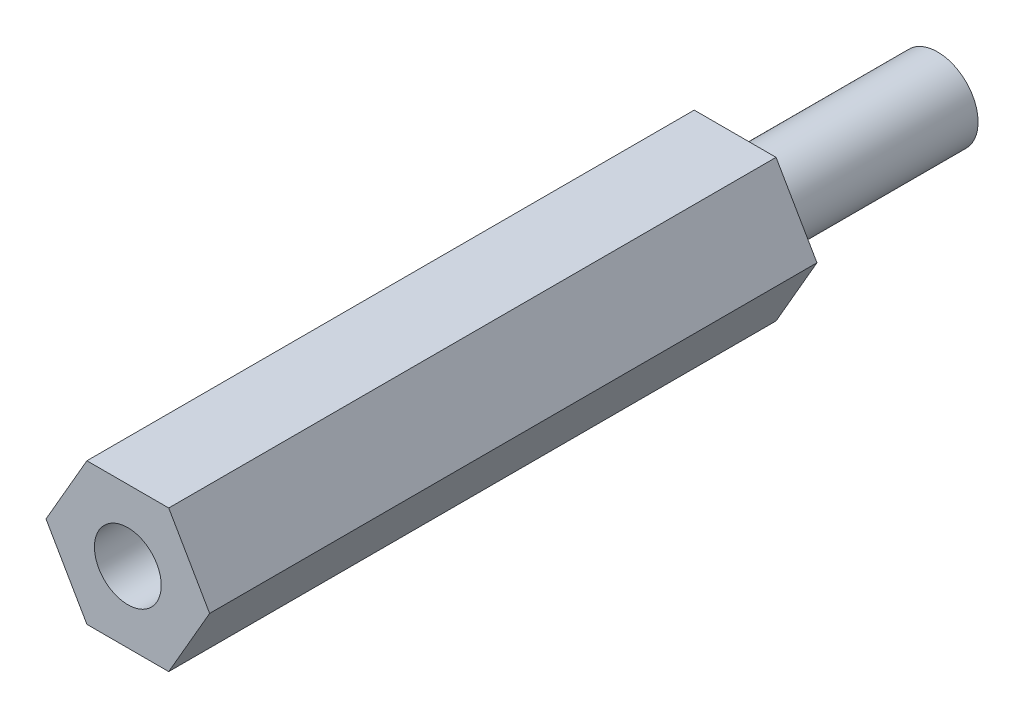
ISO-10303-21;
HEADER;
FILE_DESCRIPTION(('STEP AP214'),'2;1');
FILE_NAME('part.step','',(''),(''),'','','');
FILE_SCHEMA(('AUTOMOTIVE_DESIGN { 1 0 10303 214 1 1 1 1 }'));
ENDSEC;
DATA;
#1=APPLICATION_CONTEXT('core data for automotive mechanical design processes');
#2=APPLICATION_PROTOCOL_DEFINITION('international standard','automotive_design',2000,#1);
#3=PRODUCT_CONTEXT('',#1,'mechanical');
#4=PRODUCT('Part','Part','',(#3));
#5=PRODUCT_RELATED_PRODUCT_CATEGORY('part','',(#4));
#6=PRODUCT_DEFINITION_FORMATION('','',#4);
#7=PRODUCT_DEFINITION_CONTEXT('part definition',#1,'design');
#8=PRODUCT_DEFINITION('design','',#6,#7);
#9=PRODUCT_DEFINITION_SHAPE('','',#8);
#10=(LENGTH_UNIT() NAMED_UNIT(*) SI_UNIT(.MILLI.,.METRE.));
#11=(NAMED_UNIT(*) PLANE_ANGLE_UNIT() SI_UNIT($,.RADIAN.));
#12=(NAMED_UNIT(*) SI_UNIT($,.STERADIAN.) SOLID_ANGLE_UNIT());
#13=UNCERTAINTY_MEASURE_WITH_UNIT(LENGTH_MEASURE(1.E-05),#10,'distance_accuracy_value','');
#14=(GEOMETRIC_REPRESENTATION_CONTEXT(3) GLOBAL_UNCERTAINTY_ASSIGNED_CONTEXT((#13)) GLOBAL_UNIT_ASSIGNED_CONTEXT((#10,
#11,#12)) REPRESENTATION_CONTEXT('',''));
#15=CARTESIAN_POINT('',(0.,0.,0.));
#16=DIRECTION('',(0.,0.,1.));
#17=DIRECTION('',(1.,0.,0.));
#18=AXIS2_PLACEMENT_3D('',#15,#16,#17);
#19=CARTESIAN_POINT('',(2.02072594216369,3.5,30.));
#20=DIRECTION('',(0.,-1.,0.));
#21=DIRECTION('',(1.,0.,0.));
#22=AXIS2_PLACEMENT_3D('',#19,#20,#21);
#23=PLANE('',#22);
#24=DIRECTION('',(-1.,0.,0.));
#25=VECTOR('',#24,1.);
#26=CARTESIAN_POINT('',(2.02072594216369,3.5,0.));
#27=LINE('',#26,#25);
#28=CARTESIAN_POINT('',(2.02072594216369,3.5,0.));
#29=VERTEX_POINT('',#28);
#30=CARTESIAN_POINT('',(-2.02072594216369,3.5,0.));
#31=VERTEX_POINT('',#30);
#32=EDGE_CURVE('E123',#29,#31,#27,.T.);
#33=ORIENTED_EDGE('',*,*,#32,.T.);
#34=DIRECTION('',(0.,0.,-1.));
#35=VECTOR('',#34,1.);
#36=CARTESIAN_POINT('',(-2.02072594216369,3.5,30.));
#37=LINE('',#36,#35);
#38=CARTESIAN_POINT('',(-2.02072594216369,3.5,30.));
#39=VERTEX_POINT('',#38);
#40=EDGE_CURVE('E38',#39,#31,#37,.T.);
#41=ORIENTED_EDGE('',*,*,#40,.F.);
#42=DIRECTION('',(-1.,0.,0.));
#43=VECTOR('',#42,1.);
#44=CARTESIAN_POINT('',(2.02072594216369,3.5,30.));
#45=LINE('',#44,#43);
#46=CARTESIAN_POINT('',(2.02072594216369,3.5,30.));
#47=VERTEX_POINT('',#46);
#48=EDGE_CURVE('E134',#47,#39,#45,.T.);
#49=ORIENTED_EDGE('',*,*,#48,.F.);
#50=DIRECTION('',(0.,0.,-1.));
#51=VECTOR('',#50,1.);
#52=CARTESIAN_POINT('',(2.02072594216369,3.5,30.));
#53=LINE('',#52,#51);
#54=EDGE_CURVE('E119',#47,#29,#53,.T.);
#55=ORIENTED_EDGE('',*,*,#54,.T.);
#56=EDGE_LOOP('',(#33,#41,#49,#55));
#57=FACE_BOUND('',#56,.T.);
#58=ADVANCED_FACE('F35',(#57),#23,.F.);
#59=CARTESIAN_POINT('',(-2.02072594216369,3.5,30.));
#60=DIRECTION('',(0.866025403784439,-0.5,0.));
#61=DIRECTION('',(0.5,0.866025403784439,0.));
#62=AXIS2_PLACEMENT_3D('',#59,#60,#61);
#63=PLANE('',#62);
#64=DIRECTION('',(-0.5,-0.866025403784439,0.));
#65=VECTOR('',#64,1.);
#66=CARTESIAN_POINT('',(-2.02072594216369,3.5,0.));
#67=LINE('',#66,#65);
#68=CARTESIAN_POINT('',(-4.04145188432738,0.,0.));
#69=VERTEX_POINT('',#68);
#70=EDGE_CURVE('E126',#31,#69,#67,.T.);
#71=ORIENTED_EDGE('',*,*,#70,.T.);
#72=DIRECTION('',(0.,0.,-1.));
#73=VECTOR('',#72,1.);
#74=CARTESIAN_POINT('',(-4.04145188432738,0.,30.));
#75=LINE('',#74,#73);
#76=CARTESIAN_POINT('',(-4.04145188432738,0.,30.));
#77=VERTEX_POINT('',#76);
#78=EDGE_CURVE('E137',#77,#69,#75,.T.);
#79=ORIENTED_EDGE('',*,*,#78,.F.);
#80=DIRECTION('',(-0.5,-0.866025403784439,0.));
#81=VECTOR('',#80,1.);
#82=CARTESIAN_POINT('',(-2.02072594216369,3.5,30.));
#83=LINE('',#82,#81);
#84=EDGE_CURVE('E91',#39,#77,#83,.T.);
#85=ORIENTED_EDGE('',*,*,#84,.F.);
#86=ORIENTED_EDGE('',*,*,#40,.T.);
#87=EDGE_LOOP('',(#71,#79,#85,#86));
#88=FACE_BOUND('',#87,.T.);
#89=ADVANCED_FACE('F142',(#88),#63,.F.);
#90=CARTESIAN_POINT('',(-4.04145188432738,0.,30.));
#91=DIRECTION('',(0.866025403784439,0.5,0.));
#92=DIRECTION('',(-0.5,0.866025403784439,0.));
#93=AXIS2_PLACEMENT_3D('',#90,#91,#92);
#94=PLANE('',#93);
#95=DIRECTION('',(0.5,-0.866025403784439,0.));
#96=VECTOR('',#95,1.);
#97=CARTESIAN_POINT('',(-4.04145188432738,0.,0.));
#98=LINE('',#97,#96);
#99=CARTESIAN_POINT('',(-2.02072594216369,-3.5,0.));
#100=VERTEX_POINT('',#99);
#101=EDGE_CURVE('E129',#69,#100,#98,.T.);
#102=ORIENTED_EDGE('',*,*,#101,.T.);
#103=DIRECTION('',(0.,0.,-1.));
#104=VECTOR('',#103,1.);
#105=CARTESIAN_POINT('',(-2.02072594216369,-3.5,30.));
#106=LINE('',#105,#104);
#107=CARTESIAN_POINT('',(-2.02072594216369,-3.5,30.));
#108=VERTEX_POINT('',#107);
#109=EDGE_CURVE('E114',#108,#100,#106,.T.);
#110=ORIENTED_EDGE('',*,*,#109,.F.);
#111=DIRECTION('',(0.5,-0.866025403784439,0.));
#112=VECTOR('',#111,1.);
#113=CARTESIAN_POINT('',(-4.04145188432738,0.,30.));
#114=LINE('',#113,#112);
#115=EDGE_CURVE('E105',#77,#108,#114,.T.);
#116=ORIENTED_EDGE('',*,*,#115,.F.);
#117=ORIENTED_EDGE('',*,*,#78,.T.);
#118=EDGE_LOOP('',(#102,#110,#116,#117));
#119=FACE_BOUND('',#118,.T.);
#120=ADVANCED_FACE('F148',(#119),#94,.F.);
#121=CARTESIAN_POINT('',(-2.02072594216369,-3.5,30.));
#122=DIRECTION('',(0.,1.,0.));
#123=DIRECTION('',(-1.,0.,0.));
#124=AXIS2_PLACEMENT_3D('',#121,#122,#123);
#125=PLANE('',#124);
#126=DIRECTION('',(1.,0.,0.));
#127=VECTOR('',#126,1.);
#128=CARTESIAN_POINT('',(-2.02072594216369,-3.5,0.));
#129=LINE('',#128,#127);
#130=CARTESIAN_POINT('',(2.02072594216369,-3.5,0.));
#131=VERTEX_POINT('',#130);
#132=EDGE_CURVE('E113',#100,#131,#129,.T.);
#133=ORIENTED_EDGE('',*,*,#132,.T.);
#134=DIRECTION('',(0.,0.,-1.));
#135=VECTOR('',#134,1.);
#136=CARTESIAN_POINT('',(2.02072594216369,-3.5,30.));
#137=LINE('',#136,#135);
#138=CARTESIAN_POINT('',(2.02072594216369,-3.5,30.));
#139=VERTEX_POINT('',#138);
#140=EDGE_CURVE('E110',#139,#131,#137,.T.);
#141=ORIENTED_EDGE('',*,*,#140,.F.);
#142=DIRECTION('',(1.,0.,0.));
#143=VECTOR('',#142,1.);
#144=CARTESIAN_POINT('',(-2.02072594216369,-3.5,30.));
#145=LINE('',#144,#143);
#146=EDGE_CURVE('E99',#108,#139,#145,.T.);
#147=ORIENTED_EDGE('',*,*,#146,.F.);
#148=ORIENTED_EDGE('',*,*,#109,.T.);
#149=EDGE_LOOP('',(#133,#141,#147,#148));
#150=FACE_BOUND('',#149,.T.);
#151=ADVANCED_FACE('F111',(#150),#125,.F.);
#152=CARTESIAN_POINT('',(2.02072594216369,-3.5,30.));
#153=DIRECTION('',(-0.866025403784439,0.5,0.));
#154=DIRECTION('',(-0.5,-0.866025403784439,0.));
#155=AXIS2_PLACEMENT_3D('',#152,#153,#154);
#156=PLANE('',#155);
#157=DIRECTION('',(0.5,0.866025403784439,0.));
#158=VECTOR('',#157,1.);
#159=CARTESIAN_POINT('',(2.02072594216369,-3.5,0.));
#160=LINE('',#159,#158);
#161=CARTESIAN_POINT('',(4.04145188432738,0.,0.));
#162=VERTEX_POINT('',#161);
#163=EDGE_CURVE('E76',#131,#162,#160,.T.);
#164=ORIENTED_EDGE('',*,*,#163,.T.);
#165=DIRECTION('',(0.,0.,-1.));
#166=VECTOR('',#165,1.);
#167=CARTESIAN_POINT('',(4.04145188432738,0.,30.));
#168=LINE('',#167,#166);
#169=CARTESIAN_POINT('',(4.04145188432738,0.,30.));
#170=VERTEX_POINT('',#169);
#171=EDGE_CURVE('E115',#170,#162,#168,.T.);
#172=ORIENTED_EDGE('',*,*,#171,.F.);
#173=DIRECTION('',(0.5,0.866025403784439,0.));
#174=VECTOR('',#173,1.);
#175=CARTESIAN_POINT('',(2.02072594216369,-3.5,30.));
#176=LINE('',#175,#174);
#177=EDGE_CURVE('E103',#139,#170,#176,.T.);
#178=ORIENTED_EDGE('',*,*,#177,.F.);
#179=ORIENTED_EDGE('',*,*,#140,.T.);
#180=EDGE_LOOP('',(#164,#172,#178,#179));
#181=FACE_BOUND('',#180,.T.);
#182=ADVANCED_FACE('F117',(#181),#156,.F.);
#183=CARTESIAN_POINT('',(4.04145188432738,0.,30.));
#184=DIRECTION('',(-0.866025403784439,-0.5,0.));
#185=DIRECTION('',(0.5,-0.866025403784439,0.));
#186=AXIS2_PLACEMENT_3D('',#183,#184,#185);
#187=PLANE('',#186);
#188=DIRECTION('',(-0.5,0.866025403784438,0.));
#189=VECTOR('',#188,1.);
#190=CARTESIAN_POINT('',(4.04145188432738,0.,0.));
#191=LINE('',#190,#189);
#192=EDGE_CURVE('E82',#162,#29,#191,.T.);
#193=ORIENTED_EDGE('',*,*,#192,.T.);
#194=ORIENTED_EDGE('',*,*,#54,.F.);
#195=DIRECTION('',(-0.5,0.866025403784438,0.));
#196=VECTOR('',#195,1.);
#197=CARTESIAN_POINT('',(4.04145188432738,0.,30.));
#198=LINE('',#197,#196);
#199=EDGE_CURVE('E52',#170,#47,#198,.T.);
#200=ORIENTED_EDGE('',*,*,#199,.F.);
#201=ORIENTED_EDGE('',*,*,#171,.T.);
#202=EDGE_LOOP('',(#193,#194,#200,#201));
#203=FACE_BOUND('',#202,.T.);
#204=ADVANCED_FACE('F164',(#203),#187,.F.);
#205=CARTESIAN_POINT('',(0.,0.,30.));
#206=DIRECTION('',(0.,0.,1.));
#207=DIRECTION('',(1.,0.,0.));
#208=AXIS2_PLACEMENT_3D('',#205,#206,#207);
#209=PLANE('',#208);
#210=CARTESIAN_POINT('',(0.,0.,30.));
#211=DIRECTION('',(0.,0.,1.));
#212=DIRECTION('',(1.,0.,0.));
#213=AXIS2_PLACEMENT_3D('',#210,#211,#212);
#214=CIRCLE('',#213,1.65);
#215=CARTESIAN_POINT('',(1.65,0.,30.));
#216=VERTEX_POINT('',#215);
#217=EDGE_CURVE('E157',#216,#216,#214,.T.);
#218=ORIENTED_EDGE('',*,*,#217,.F.);
#219=EDGE_LOOP('',(#218));
#220=FACE_BOUND('',#219,.T.);
#221=ORIENTED_EDGE('',*,*,#48,.T.);
#222=ORIENTED_EDGE('',*,*,#84,.T.);
#223=ORIENTED_EDGE('',*,*,#115,.T.);
#224=ORIENTED_EDGE('',*,*,#146,.T.);
#225=ORIENTED_EDGE('',*,*,#177,.T.);
#226=ORIENTED_EDGE('',*,*,#199,.T.);
#227=EDGE_LOOP('',(#221,#222,#223,#224,#225,#226));
#228=FACE_BOUND('',#227,.T.);
#229=ADVANCED_FACE('F101',(#220,#228),#209,.T.);
#230=CARTESIAN_POINT('',(0.,0.,0.));
#231=DIRECTION('',(0.,0.,1.));
#232=DIRECTION('',(1.,0.,0.));
#233=AXIS2_PLACEMENT_3D('',#230,#231,#232);
#234=PLANE('',#233);
#235=CARTESIAN_POINT('',(0.,0.,0.));
#236=DIRECTION('',(0.,0.,-1.));
#237=DIRECTION('',(-1.,0.,0.));
#238=AXIS2_PLACEMENT_3D('',#235,#236,#237);
#239=CIRCLE('',#238,2.);
#240=CARTESIAN_POINT('',(-2.,0.,0.));
#241=VERTEX_POINT('',#240);
#242=EDGE_CURVE('E11',#241,#241,#239,.T.);
#243=ORIENTED_EDGE('',*,*,#242,.F.);
#244=EDGE_LOOP('',(#243));
#245=FACE_BOUND('',#244,.T.);
#246=ORIENTED_EDGE('',*,*,#32,.F.);
#247=ORIENTED_EDGE('',*,*,#192,.F.);
#248=ORIENTED_EDGE('',*,*,#163,.F.);
#249=ORIENTED_EDGE('',*,*,#132,.F.);
#250=ORIENTED_EDGE('',*,*,#101,.F.);
#251=ORIENTED_EDGE('',*,*,#70,.F.);
#252=EDGE_LOOP('',(#246,#247,#248,#249,#250,#251));
#253=FACE_BOUND('',#252,.T.);
#254=ADVANCED_FACE('F147',(#245,#253),#234,.F.);
#255=CARTESIAN_POINT('',(0.,0.,-10.));
#256=DIRECTION('',(0.,0.,1.));
#257=DIRECTION('',(1.,0.,0.));
#258=AXIS2_PLACEMENT_3D('',#255,#256,#257);
#259=CYLINDRICAL_SURFACE('',#258,2.);
#260=CARTESIAN_POINT('',(0.,0.,-10.));
#261=DIRECTION('',(0.,0.,-1.));
#262=DIRECTION('',(-1.,0.,0.));
#263=AXIS2_PLACEMENT_3D('',#260,#261,#262);
#264=CIRCLE('',#263,2.);
#265=CARTESIAN_POINT('',(-2.,0.,-10.));
#266=VERTEX_POINT('',#265);
#267=EDGE_CURVE('E127',#266,#266,#264,.T.);
#268=ORIENTED_EDGE('',*,*,#267,.F.);
#269=EDGE_LOOP('',(#268));
#270=FACE_BOUND('',#269,.T.);
#271=ORIENTED_EDGE('',*,*,#242,.T.);
#272=EDGE_LOOP('',(#271));
#273=FACE_BOUND('',#272,.T.);
#274=ADVANCED_FACE('F170',(#270,#273),#259,.T.);
#275=CARTESIAN_POINT('',(0.,0.,-10.));
#276=DIRECTION('',(0.,0.,-1.));
#277=DIRECTION('',(-1.,0.,0.));
#278=AXIS2_PLACEMENT_3D('',#275,#276,#277);
#279=PLANE('',#278);
#280=ORIENTED_EDGE('',*,*,#267,.T.);
#281=EDGE_LOOP('',(#280));
#282=FACE_BOUND('',#281,.T.);
#283=ADVANCED_FACE('F211',(#282),#279,.T.);
#284=CARTESIAN_POINT('',(0.,0.,19.9));
#285=DIRECTION('',(0.,0.,1.));
#286=DIRECTION('',(1.,0.,0.));
#287=AXIS2_PLACEMENT_3D('',#284,#285,#286);
#288=CONICAL_SURFACE('',#287,1.65,1.02974425867665);
#289=CARTESIAN_POINT('',(0.,0.,18.9085799786045));
#290=VERTEX_POINT('',#289);
#291=VERTEX_LOOP('',#290);
#292=FACE_BOUND('',#291,.T.);
#293=CARTESIAN_POINT('',(0.,0.,19.9));
#294=DIRECTION('',(0.,0.,1.));
#295=DIRECTION('',(1.,0.,0.));
#296=AXIS2_PLACEMENT_3D('',#293,#294,#295);
#297=CIRCLE('',#296,1.65);
#298=CARTESIAN_POINT('',(1.65,0.,19.9));
#299=VERTEX_POINT('',#298);
#300=EDGE_CURVE('E154',#299,#299,#297,.T.);
#301=ORIENTED_EDGE('',*,*,#300,.T.);
#302=EDGE_LOOP('',(#301));
#303=FACE_BOUND('',#302,.T.);
#304=ADVANCED_FACE('F219',(#292,#303),#288,.F.);
#305=CARTESIAN_POINT('',(0.,0.,30.));
#306=DIRECTION('',(0.,0.,1.));
#307=DIRECTION('',(1.,0.,0.));
#308=AXIS2_PLACEMENT_3D('',#305,#306,#307);
#309=CYLINDRICAL_SURFACE('',#308,1.65);
#310=ORIENTED_EDGE('',*,*,#300,.F.);
#311=EDGE_LOOP('',(#310));
#312=FACE_BOUND('',#311,.T.);
#313=ORIENTED_EDGE('',*,*,#217,.T.);
#314=EDGE_LOOP('',(#313));
#315=FACE_BOUND('',#314,.T.);
#316=ADVANCED_FACE('F161',(#312,#315),#309,.F.);
#317=CLOSED_SHELL('',(#58,#89,#120,#151,#182,#204,#229,#254,#274,#283,#304,#316));
#318=MANIFOLD_SOLID_BREP('B2',#317);
#319=ADVANCED_BREP_SHAPE_REPRESENTATION('',(#18,#318),#14);
#320=SHAPE_DEFINITION_REPRESENTATION(#9,#319);
ENDSEC;
END-ISO-10303-21;
